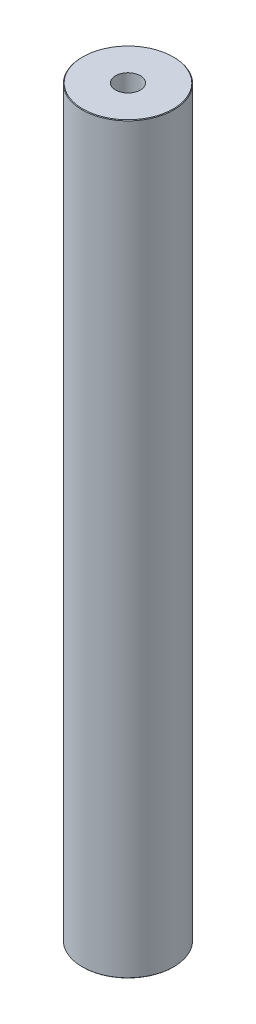
ISO-10303-21;
HEADER;
FILE_DESCRIPTION(('STEP AP214'),'2;1');
FILE_NAME('part.step','',(''),(''),'','','');
FILE_SCHEMA(('AUTOMOTIVE_DESIGN { 1 0 10303 214 1 1 1 1 }'));
ENDSEC;
DATA;
#1=APPLICATION_CONTEXT('core data for automotive mechanical design processes');
#2=APPLICATION_PROTOCOL_DEFINITION('international standard','automotive_design',2000,#1);
#3=PRODUCT_CONTEXT('',#1,'mechanical');
#4=PRODUCT('Part','Part','',(#3));
#5=PRODUCT_RELATED_PRODUCT_CATEGORY('part','',(#4));
#6=PRODUCT_DEFINITION_FORMATION('','',#4);
#7=PRODUCT_DEFINITION_CONTEXT('part definition',#1,'design');
#8=PRODUCT_DEFINITION('design','',#6,#7);
#9=PRODUCT_DEFINITION_SHAPE('','',#8);
#10=(LENGTH_UNIT() NAMED_UNIT(*) SI_UNIT(.MILLI.,.METRE.));
#11=(NAMED_UNIT(*) PLANE_ANGLE_UNIT() SI_UNIT($,.RADIAN.));
#12=(NAMED_UNIT(*) SI_UNIT($,.STERADIAN.) SOLID_ANGLE_UNIT());
#13=UNCERTAINTY_MEASURE_WITH_UNIT(LENGTH_MEASURE(1.E-05),#10,'distance_accuracy_value','');
#14=(GEOMETRIC_REPRESENTATION_CONTEXT(3) GLOBAL_UNCERTAINTY_ASSIGNED_CONTEXT((#13)) GLOBAL_UNIT_ASSIGNED_CONTEXT((#10,
#11,#12)) REPRESENTATION_CONTEXT('',''));
#15=CARTESIAN_POINT('',(0.,0.,0.));
#16=DIRECTION('',(0.,0.,1.));
#17=DIRECTION('',(1.,0.,0.));
#18=AXIS2_PLACEMENT_3D('',#15,#16,#17);
#19=CARTESIAN_POINT('',(0.,324.92665828016,0.));
#20=DIRECTION('',(0.,-1.,0.));
#21=DIRECTION('',(0.,0.,-1.));
#22=AXIS2_PLACEMENT_3D('',#19,#20,#21);
#23=CYLINDRICAL_SURFACE('',#22,20.);
#24=CARTESIAN_POINT('',(0.,324.67050256197,0.));
#25=DIRECTION('',(0.,1.,0.));
#26=DIRECTION('',(0.,0.,1.));
#27=AXIS2_PLACEMENT_3D('',#24,#25,#26);
#28=CIRCLE('',#27,20.);
#29=CARTESIAN_POINT('',(0.,324.67050256197,20.));
#30=VERTEX_POINT('',#29);
#31=EDGE_CURVE('E50',#30,#30,#28,.F.);
#32=ORIENTED_EDGE('',*,*,#31,.T.);
#33=EDGE_LOOP('',(#32));
#34=FACE_BOUND('',#33,.T.);
#35=CARTESIAN_POINT('',(0.,0.256155718190598,0.));
#36=DIRECTION('',(0.,1.,0.));
#37=DIRECTION('',(0.,0.,1.));
#38=AXIS2_PLACEMENT_3D('',#35,#36,#37);
#39=CIRCLE('',#38,20.);
#40=CARTESIAN_POINT('',(0.,0.256155718190598,20.));
#41=VERTEX_POINT('',#40);
#42=EDGE_CURVE('E51',#41,#41,#39,.T.);
#43=ORIENTED_EDGE('',*,*,#42,.T.);
#44=EDGE_LOOP('',(#43));
#45=FACE_BOUND('',#44,.T.);
#46=ADVANCED_FACE('F39',(#34,#45),#23,.T.);
#47=CARTESIAN_POINT('',(0.,324.92665828016,0.));
#48=DIRECTION('',(0.,1.,0.));
#49=DIRECTION('',(0.,0.,1.));
#50=AXIS2_PLACEMENT_3D('',#47,#48,#49);
#51=PLANE('',#50);
#52=CARTESIAN_POINT('',(0.,324.92665828016,0.));
#53=DIRECTION('',(0.,1.,0.));
#54=DIRECTION('',(0.,0.,1.));
#55=AXIS2_PLACEMENT_3D('',#52,#53,#54);
#56=CIRCLE('',#55,19.7438442818094);
#57=CARTESIAN_POINT('',(0.,324.92665828016,19.7438442818094));
#58=VERTEX_POINT('',#57);
#59=EDGE_CURVE('E54',#58,#58,#56,.T.);
#60=ORIENTED_EDGE('',*,*,#59,.T.);
#61=EDGE_LOOP('',(#60));
#62=FACE_BOUND('',#61,.T.);
#63=CARTESIAN_POINT('',(0.,324.92665828016,0.));
#64=DIRECTION('',(0.,1.,0.));
#65=DIRECTION('',(0.,0.,1.));
#66=AXIS2_PLACEMENT_3D('',#63,#64,#65);
#67=CIRCLE('',#66,5.43815530481675);
#68=CARTESIAN_POINT('',(0.,324.92665828016,5.43815530481675));
#69=VERTEX_POINT('',#68);
#70=EDGE_CURVE('E58',#69,#69,#67,.T.);
#71=ORIENTED_EDGE('',*,*,#70,.F.);
#72=EDGE_LOOP('',(#71));
#73=FACE_BOUND('',#72,.T.);
#74=ADVANCED_FACE('F69',(#62,#73),#51,.T.);
#75=CARTESIAN_POINT('',(0.,0.,0.));
#76=DIRECTION('',(0.,1.,0.));
#77=DIRECTION('',(0.,0.,1.));
#78=AXIS2_PLACEMENT_3D('',#75,#76,#77);
#79=PLANE('',#78);
#80=CARTESIAN_POINT('',(0.,0.,0.));
#81=DIRECTION('',(0.,1.,0.));
#82=DIRECTION('',(0.,0.,1.));
#83=AXIS2_PLACEMENT_3D('',#80,#81,#82);
#84=CIRCLE('',#83,19.7438442818094);
#85=CARTESIAN_POINT('',(0.,0.,19.7438442818094));
#86=VERTEX_POINT('',#85);
#87=EDGE_CURVE('E10',#86,#86,#84,.F.);
#88=ORIENTED_EDGE('',*,*,#87,.T.);
#89=EDGE_LOOP('',(#88));
#90=FACE_BOUND('',#89,.T.);
#91=CARTESIAN_POINT('',(0.,0.,0.));
#92=DIRECTION('',(0.,1.,0.));
#93=DIRECTION('',(0.,0.,1.));
#94=AXIS2_PLACEMENT_3D('',#91,#92,#93);
#95=CIRCLE('',#94,5.43815530481675);
#96=CARTESIAN_POINT('',(0.,0.,5.43815530481675));
#97=VERTEX_POINT('',#96);
#98=EDGE_CURVE('E63',#97,#97,#95,.T.);
#99=ORIENTED_EDGE('',*,*,#98,.T.);
#100=EDGE_LOOP('',(#99));
#101=FACE_BOUND('',#100,.T.);
#102=ADVANCED_FACE('F75',(#90,#101),#79,.F.);
#103=CARTESIAN_POINT('',(0.,324.92665828016,0.));
#104=DIRECTION('',(0.,-1.,0.));
#105=DIRECTION('',(0.,0.,-1.));
#106=AXIS2_PLACEMENT_3D('',#103,#104,#105);
#107=CYLINDRICAL_SURFACE('',#106,5.43815530481675);
#108=ORIENTED_EDGE('',*,*,#70,.T.);
#109=EDGE_LOOP('',(#108));
#110=FACE_BOUND('',#109,.T.);
#111=ORIENTED_EDGE('',*,*,#98,.F.);
#112=EDGE_LOOP('',(#111));
#113=FACE_BOUND('',#112,.T.);
#114=ADVANCED_FACE('F70',(#110,#113),#107,.F.);
#115=CARTESIAN_POINT('',(0.,324.92665828016,0.));
#116=DIRECTION('',(0.,-1.,0.));
#117=DIRECTION('',(0.,0.,-1.));
#118=AXIS2_PLACEMENT_3D('',#115,#116,#117);
#119=CONICAL_SURFACE('',#118,19.7438442818094,0.785398163397415);
#120=ORIENTED_EDGE('',*,*,#31,.F.);
#121=EDGE_LOOP('',(#120));
#122=FACE_BOUND('',#121,.T.);
#123=ORIENTED_EDGE('',*,*,#59,.F.);
#124=EDGE_LOOP('',(#123));
#125=FACE_BOUND('',#124,.T.);
#126=ADVANCED_FACE('F81',(#122,#125),#119,.T.);
#127=CARTESIAN_POINT('',(0.,0.256155718190598,0.));
#128=DIRECTION('',(0.,1.,0.));
#129=DIRECTION('',(0.,0.,1.));
#130=AXIS2_PLACEMENT_3D('',#127,#128,#129);
#131=CONICAL_SURFACE('',#130,20.,0.785398163397469);
#132=ORIENTED_EDGE('',*,*,#87,.F.);
#133=EDGE_LOOP('',(#132));
#134=FACE_BOUND('',#133,.T.);
#135=ORIENTED_EDGE('',*,*,#42,.F.);
#136=EDGE_LOOP('',(#135));
#137=FACE_BOUND('',#136,.T.);
#138=ADVANCED_FACE('F45',(#134,#137),#131,.T.);
#139=CLOSED_SHELL('',(#46,#74,#102,#114,#126,#138));
#140=MANIFOLD_SOLID_BREP('B2',#139);
#141=ADVANCED_BREP_SHAPE_REPRESENTATION('',(#18,#140),#14);
#142=SHAPE_DEFINITION_REPRESENTATION(#9,#141);
ENDSEC;
END-ISO-10303-21;
